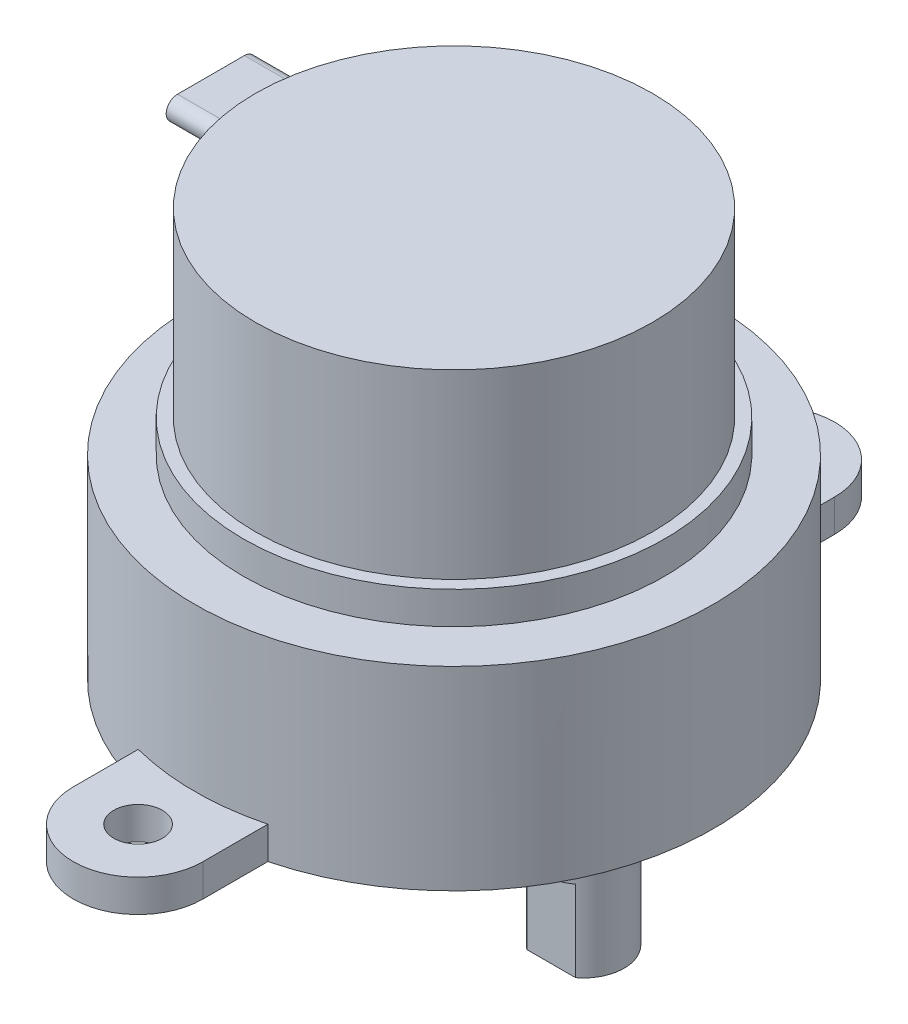
ISO-10303-21;
HEADER;
FILE_DESCRIPTION(('STEP AP214'),'2;1');
FILE_NAME('part.step','',(''),(''),'','','');
FILE_SCHEMA(('AUTOMOTIVE_DESIGN { 1 0 10303 214 1 1 1 1 }'));
ENDSEC;
DATA;
#1=APPLICATION_CONTEXT('core data for automotive mechanical design processes');
#2=APPLICATION_PROTOCOL_DEFINITION('international standard','automotive_design',2000,#1);
#3=PRODUCT_CONTEXT('',#1,'mechanical');
#4=PRODUCT('Part','Part','',(#3));
#5=PRODUCT_RELATED_PRODUCT_CATEGORY('part','',(#4));
#6=PRODUCT_DEFINITION_FORMATION('','',#4);
#7=PRODUCT_DEFINITION_CONTEXT('part definition',#1,'design');
#8=PRODUCT_DEFINITION('design','',#6,#7);
#9=PRODUCT_DEFINITION_SHAPE('','',#8);
#10=(LENGTH_UNIT() NAMED_UNIT(*) SI_UNIT(.MILLI.,.METRE.));
#11=(NAMED_UNIT(*) PLANE_ANGLE_UNIT() SI_UNIT($,.RADIAN.));
#12=(NAMED_UNIT(*) SI_UNIT($,.STERADIAN.) SOLID_ANGLE_UNIT());
#13=UNCERTAINTY_MEASURE_WITH_UNIT(LENGTH_MEASURE(1.E-05),#10,'distance_accuracy_value','');
#14=(GEOMETRIC_REPRESENTATION_CONTEXT(3) GLOBAL_UNCERTAINTY_ASSIGNED_CONTEXT((#13)) GLOBAL_UNIT_ASSIGNED_CONTEXT((#10,
#11,#12)) REPRESENTATION_CONTEXT('',''));
#15=CARTESIAN_POINT('',(0.,0.,0.));
#16=DIRECTION('',(0.,0.,1.));
#17=DIRECTION('',(1.,0.,0.));
#18=AXIS2_PLACEMENT_3D('',#15,#16,#17);
#19=CARTESIAN_POINT('',(0.,0.,0.));
#20=DIRECTION('',(0.,1.,0.));
#21=DIRECTION('',(0.,0.,1.));
#22=AXIS2_PLACEMENT_3D('',#19,#20,#21);
#23=PLANE('',#22);
#24=CARTESIAN_POINT('',(8.,0.,0.));
#25=DIRECTION('',(0.,1.,0.));
#26=DIRECTION('',(-1.,0.,0.));
#27=AXIS2_PLACEMENT_3D('',#24,#25,#26);
#28=CIRCLE('',#27,4.5);
#29=CARTESIAN_POINT('',(3.5,0.,0.));
#30=VERTEX_POINT('',#29);
#31=EDGE_CURVE('E273',#30,#30,#28,.T.);
#32=ORIENTED_EDGE('',*,*,#31,.T.);
#33=EDGE_LOOP('',(#32));
#34=FACE_BOUND('',#33,.T.);
#35=CARTESIAN_POINT('',(0.,0.,0.));
#36=DIRECTION('',(0.,-1.,0.));
#37=DIRECTION('',(0.,0.,-1.));
#38=AXIS2_PLACEMENT_3D('',#35,#36,#37);
#39=CIRCLE('',#38,16.);
#40=CARTESIAN_POINT('',(4.,0.,-15.4919333848297));
#41=VERTEX_POINT('',#40);
#42=CARTESIAN_POINT('',(3.99999999999999,0.,15.4919333848297));
#43=VERTEX_POINT('',#42);
#44=EDGE_CURVE('E292',#41,#43,#39,.T.);
#45=ORIENTED_EDGE('',*,*,#44,.T.);
#46=DIRECTION('',(0.,0.,1.));
#47=VECTOR('',#46,1.);
#48=CARTESIAN_POINT('',(4.,0.,-19.5));
#49=LINE('',#48,#47);
#50=CARTESIAN_POINT('',(3.99999999999999,0.,19.5));
#51=VERTEX_POINT('',#50);
#52=EDGE_CURVE('E221',#43,#51,#49,.T.);
#53=ORIENTED_EDGE('',*,*,#52,.T.);
#54=CARTESIAN_POINT('',(0.,0.,19.5));
#55=DIRECTION('',(0.,-1.,0.));
#56=DIRECTION('',(0.,0.,-1.));
#57=AXIS2_PLACEMENT_3D('',#54,#55,#56);
#58=CIRCLE('',#57,4.);
#59=CARTESIAN_POINT('',(-4.00000000000001,0.,19.5));
#60=VERTEX_POINT('',#59);
#61=EDGE_CURVE('E224',#51,#60,#58,.T.);
#62=ORIENTED_EDGE('',*,*,#61,.T.);
#63=DIRECTION('',(0.,0.,-1.));
#64=VECTOR('',#63,1.);
#65=CARTESIAN_POINT('',(-4.,0.,-19.5));
#66=LINE('',#65,#64);
#67=CARTESIAN_POINT('',(-4.,0.,15.4919333848297));
#68=VERTEX_POINT('',#67);
#69=EDGE_CURVE('E67',#60,#68,#66,.T.);
#70=ORIENTED_EDGE('',*,*,#69,.T.);
#71=CARTESIAN_POINT('',(-4.,0.,-15.4919333848297));
#72=VERTEX_POINT('',#71);
#73=EDGE_CURVE('E291',#68,#72,#39,.T.);
#74=ORIENTED_EDGE('',*,*,#73,.T.);
#75=CARTESIAN_POINT('',(-4.,0.,-19.5));
#76=VERTEX_POINT('',#75);
#77=EDGE_CURVE('E226',#72,#76,#66,.T.);
#78=ORIENTED_EDGE('',*,*,#77,.T.);
#79=CARTESIAN_POINT('',(0.,0.,-19.5));
#80=DIRECTION('',(0.,-1.,0.));
#81=DIRECTION('',(0.,0.,-1.));
#82=AXIS2_PLACEMENT_3D('',#79,#80,#81);
#83=CIRCLE('',#82,4.);
#84=CARTESIAN_POINT('',(4.,0.,-19.5));
#85=VERTEX_POINT('',#84);
#86=EDGE_CURVE('E201',#76,#85,#83,.T.);
#87=ORIENTED_EDGE('',*,*,#86,.T.);
#88=EDGE_CURVE('E222',#85,#41,#49,.T.);
#89=ORIENTED_EDGE('',*,*,#88,.T.);
#90=EDGE_LOOP('',(#45,#53,#62,#70,#74,#78,#87,#89));
#91=FACE_BOUND('',#90,.T.);
#92=CARTESIAN_POINT('',(0.,0.,-19.5));
#93=DIRECTION('',(0.,-1.,0.));
#94=DIRECTION('',(0.,0.,-1.));
#95=AXIS2_PLACEMENT_3D('',#92,#93,#94);
#96=CIRCLE('',#95,1.5);
#97=CARTESIAN_POINT('',(0.,0.,-21.));
#98=VERTEX_POINT('',#97);
#99=EDGE_CURVE('E195',#98,#98,#96,.T.);
#100=ORIENTED_EDGE('',*,*,#99,.F.);
#101=EDGE_LOOP('',(#100));
#102=FACE_BOUND('',#101,.T.);
#103=CARTESIAN_POINT('',(0.,0.,19.5));
#104=DIRECTION('',(0.,-1.,0.));
#105=DIRECTION('',(0.,0.,-1.));
#106=AXIS2_PLACEMENT_3D('',#103,#104,#105);
#107=CIRCLE('',#106,1.5);
#108=CARTESIAN_POINT('',(0.,0.,18.));
#109=VERTEX_POINT('',#108);
#110=EDGE_CURVE('E187',#109,#109,#107,.T.);
#111=ORIENTED_EDGE('',*,*,#110,.F.);
#112=EDGE_LOOP('',(#111));
#113=FACE_BOUND('',#112,.T.);
#114=ADVANCED_FACE('F40',(#34,#91,#102,#113),#23,.F.);
#115=CARTESIAN_POINT('',(0.,0.,0.));
#116=DIRECTION('',(0.,-1.,0.));
#117=DIRECTION('',(0.,0.,-1.));
#118=AXIS2_PLACEMENT_3D('',#115,#116,#117);
#119=CYLINDRICAL_SURFACE('',#118,16.);
#120=ORIENTED_EDGE('',*,*,#73,.F.);
#121=DIRECTION('',(0.,-1.,0.));
#122=VECTOR('',#121,1.);
#123=CARTESIAN_POINT('',(-4.,0.,15.4919333848297));
#124=LINE('',#123,#122);
#125=CARTESIAN_POINT('',(-4.,2.,15.4919333848297));
#126=VERTEX_POINT('',#125);
#127=EDGE_CURVE('E316',#68,#126,#124,.F.);
#128=ORIENTED_EDGE('',*,*,#127,.T.);
#129=CARTESIAN_POINT('',(0.,2.,0.));
#130=DIRECTION('',(0.,-1.,0.));
#131=DIRECTION('',(0.,0.,-1.));
#132=AXIS2_PLACEMENT_3D('',#129,#130,#131);
#133=CIRCLE('',#132,16.);
#134=CARTESIAN_POINT('',(3.99999999999999,2.,15.4919333848297));
#135=VERTEX_POINT('',#134);
#136=EDGE_CURVE('E307',#135,#126,#133,.T.);
#137=ORIENTED_EDGE('',*,*,#136,.F.);
#138=DIRECTION('',(0.,-1.,0.));
#139=VECTOR('',#138,1.);
#140=CARTESIAN_POINT('',(3.99999999999999,0.,15.4919333848297));
#141=LINE('',#140,#139);
#142=EDGE_CURVE('E313',#135,#43,#141,.T.);
#143=ORIENTED_EDGE('',*,*,#142,.T.);
#144=ORIENTED_EDGE('',*,*,#44,.F.);
#145=DIRECTION('',(0.,-1.,0.));
#146=VECTOR('',#145,1.);
#147=CARTESIAN_POINT('',(4.,0.,-15.4919333848297));
#148=LINE('',#147,#146);
#149=CARTESIAN_POINT('',(4.,2.,-15.4919333848297));
#150=VERTEX_POINT('',#149);
#151=EDGE_CURVE('E306',#41,#150,#148,.F.);
#152=ORIENTED_EDGE('',*,*,#151,.T.);
#153=CARTESIAN_POINT('',(-4.,2.,-15.4919333848297));
#154=VERTEX_POINT('',#153);
#155=EDGE_CURVE('E304',#154,#150,#133,.T.);
#156=ORIENTED_EDGE('',*,*,#155,.F.);
#157=DIRECTION('',(0.,-1.,0.));
#158=VECTOR('',#157,1.);
#159=CARTESIAN_POINT('',(-4.,0.,-15.4919333848297));
#160=LINE('',#159,#158);
#161=EDGE_CURVE('E310',#154,#72,#160,.T.);
#162=ORIENTED_EDGE('',*,*,#161,.T.);
#163=EDGE_LOOP('',(#120,#128,#137,#143,#144,#152,#156,#162));
#164=FACE_BOUND('',#163,.T.);
#165=CARTESIAN_POINT('',(0.,12.,0.));
#166=DIRECTION('',(0.,-1.,0.));
#167=DIRECTION('',(0.,0.,-1.));
#168=AXIS2_PLACEMENT_3D('',#165,#166,#167);
#169=CIRCLE('',#168,16.);
#170=CARTESIAN_POINT('',(0.,12.,-16.));
#171=VERTEX_POINT('',#170);
#172=EDGE_CURVE('E288',#171,#171,#169,.T.);
#173=ORIENTED_EDGE('',*,*,#172,.T.);
#174=EDGE_LOOP('',(#173));
#175=FACE_BOUND('',#174,.T.);
#176=ADVANCED_FACE('F430',(#164,#175),#119,.T.);
#177=CARTESIAN_POINT('',(-16.,12.,0.));
#178=DIRECTION('',(0.,-1.,0.));
#179=DIRECTION('',(0.,0.,-1.));
#180=AXIS2_PLACEMENT_3D('',#177,#178,#179);
#181=PLANE('',#180);
#182=ORIENTED_EDGE('',*,*,#172,.F.);
#183=EDGE_LOOP('',(#182));
#184=FACE_BOUND('',#183,.T.);
#185=CARTESIAN_POINT('',(0.,12.,0.));
#186=DIRECTION('',(0.,-1.,0.));
#187=DIRECTION('',(0.,0.,-1.));
#188=AXIS2_PLACEMENT_3D('',#185,#186,#187);
#189=CIRCLE('',#188,13.);
#190=CARTESIAN_POINT('',(0.,12.,-13.));
#191=VERTEX_POINT('',#190);
#192=EDGE_CURVE('E285',#191,#191,#189,.T.);
#193=ORIENTED_EDGE('',*,*,#192,.T.);
#194=EDGE_LOOP('',(#193));
#195=FACE_BOUND('',#194,.T.);
#196=ADVANCED_FACE('F435',(#184,#195),#181,.F.);
#197=CARTESIAN_POINT('',(0.,0.,0.));
#198=DIRECTION('',(0.,-1.,0.));
#199=DIRECTION('',(0.,0.,-1.));
#200=AXIS2_PLACEMENT_3D('',#197,#198,#199);
#201=CYLINDRICAL_SURFACE('',#200,13.);
#202=ORIENTED_EDGE('',*,*,#192,.F.);
#203=EDGE_LOOP('',(#202));
#204=FACE_BOUND('',#203,.T.);
#205=CARTESIAN_POINT('',(0.,14.,0.));
#206=DIRECTION('',(0.,-1.,0.));
#207=DIRECTION('',(0.,0.,-1.));
#208=AXIS2_PLACEMENT_3D('',#205,#206,#207);
#209=CIRCLE('',#208,13.);
#210=CARTESIAN_POINT('',(0.,14.,-13.));
#211=VERTEX_POINT('',#210);
#212=EDGE_CURVE('E282',#211,#211,#209,.T.);
#213=ORIENTED_EDGE('',*,*,#212,.T.);
#214=EDGE_LOOP('',(#213));
#215=FACE_BOUND('',#214,.T.);
#216=ADVANCED_FACE('F648',(#204,#215),#201,.T.);
#217=CARTESIAN_POINT('',(-13.,14.,0.));
#218=DIRECTION('',(0.,-1.,0.));
#219=DIRECTION('',(0.,0.,-1.));
#220=AXIS2_PLACEMENT_3D('',#217,#218,#219);
#221=PLANE('',#220);
#222=ORIENTED_EDGE('',*,*,#212,.F.);
#223=EDGE_LOOP('',(#222));
#224=FACE_BOUND('',#223,.T.);
#225=CARTESIAN_POINT('',(0.,14.,0.));
#226=DIRECTION('',(0.,-1.,0.));
#227=DIRECTION('',(0.,0.,-1.));
#228=AXIS2_PLACEMENT_3D('',#225,#226,#227);
#229=CIRCLE('',#228,12.25);
#230=CARTESIAN_POINT('',(0.,14.,-12.25));
#231=VERTEX_POINT('',#230);
#232=EDGE_CURVE('E279',#231,#231,#229,.T.);
#233=ORIENTED_EDGE('',*,*,#232,.T.);
#234=EDGE_LOOP('',(#233));
#235=FACE_BOUND('',#234,.T.);
#236=ADVANCED_FACE('F426',(#224,#235),#221,.F.);
#237=CARTESIAN_POINT('',(0.,0.,0.));
#238=DIRECTION('',(0.,-1.,0.));
#239=DIRECTION('',(0.,0.,-1.));
#240=AXIS2_PLACEMENT_3D('',#237,#238,#239);
#241=CYLINDRICAL_SURFACE('',#240,12.25);
#242=CARTESIAN_POINT('',(0.,24.8102935502322,0.));
#243=DIRECTION('',(0.,-1.,0.));
#244=DIRECTION('',(0.,0.,-1.));
#245=AXIS2_PLACEMENT_3D('',#242,#243,#244);
#246=CIRCLE('',#245,12.25);
#247=CARTESIAN_POINT('',(-12.0746386421325,24.8102935502322,2.06533330528554));
#248=VERTEX_POINT('',#247);
#249=CARTESIAN_POINT('',(-12.0746386421325,24.8102935502322,-2.06533330528554));
#250=VERTEX_POINT('',#249);
#251=EDGE_CURVE('E52',#248,#250,#246,.T.);
#252=ORIENTED_EDGE('',*,*,#251,.F.);
#253=CARTESIAN_POINT('',(-12.1736877517312,24.1101805653897,1.36522032044298));
#254=CARTESIAN_POINT('',(-12.1736877254974,24.1492983631001,1.36522205826182));
#255=CARTESIAN_POINT('',(-12.1733202199056,24.1884437928392,1.36851003883782));
#256=CARTESIAN_POINT('',(-12.1718440130067,24.26565372532,1.38157695674786));
#257=CARTESIAN_POINT('',(-12.1707344440778,24.3037169083244,1.39136349210879));
#258=CARTESIAN_POINT('',(-12.1677602722196,24.3776317389549,1.41713698782575));
#259=CARTESIAN_POINT('',(-12.1658960781671,24.4134845721068,1.43312059024172));
#260=CARTESIAN_POINT('',(-12.1613965948713,24.4819759922711,1.47081315580985));
#261=CARTESIAN_POINT('',(-12.1587614918081,24.5146153528196,1.49252073645505));
#262=CARTESIAN_POINT('',(-12.1527033761418,24.575836841953,1.5410705296342));
#263=CARTESIAN_POINT('',(-12.1492789063223,24.6044113067581,1.56792222281675));
#264=CARTESIAN_POINT('',(-12.1416492660843,24.6566446597768,1.62594823862026));
#265=CARTESIAN_POINT('',(-12.137444051561,24.6803032701299,1.65712280541863));
#266=CARTESIAN_POINT('',(-12.1282562018091,24.7221921106059,1.72308299167752));
#267=CARTESIAN_POINT('',(-12.1232691725918,24.740389853456,1.75788862430097));
#268=CARTESIAN_POINT('',(-12.1126003766949,24.7706985050246,1.82995574107636));
#269=CARTESIAN_POINT('',(-12.1069185769698,24.7828091240796,1.86721734200328));
#270=CARTESIAN_POINT('',(-12.0949031784823,24.8007420088311,1.94353374546836));
#271=CARTESIAN_POINT('',(-12.088563515276,24.8064987851686,1.98260297589541));
#272=CARTESIAN_POINT('',(-12.0754312617295,24.8113838224086,2.06107807197321));
#273=CARTESIAN_POINT('',(-12.0686386388353,24.8105116063782,2.10048396164168));
#274=CARTESIAN_POINT('',(-12.054706976681,24.8021422239762,2.17902495272667));
#275=CARTESIAN_POINT('',(-12.0475647253628,24.7945644801897,2.21815090720408));
#276=CARTESIAN_POINT('',(-12.033247439735,24.7728976893347,2.29455177185041));
#277=CARTESIAN_POINT('',(-12.0260724033596,24.758808226213,2.33182656357447));
#278=CARTESIAN_POINT('',(-12.0119064614862,24.7243795953467,2.40373804618856));
#279=CARTESIAN_POINT('',(-12.0049171767106,24.7039977913366,2.43835466364108));
#280=CARTESIAN_POINT('',(-11.9914662720498,24.6575623621294,2.50366732948619));
#281=CARTESIAN_POINT('',(-11.9850046458184,24.6315088051622,2.53436342503478));
#282=CARTESIAN_POINT('',(-11.9729453429544,24.5746202996017,2.59073485167142));
#283=CARTESIAN_POINT('',(-11.9673422506743,24.5438180104977,2.61644195333348));
#284=CARTESIAN_POINT('',(-11.9572268811007,24.478155810664,2.66228818375921));
#285=CARTESIAN_POINT('',(-11.9527144732588,24.4432963862898,2.68242797893775));
#286=CARTESIAN_POINT('',(-11.9450999960425,24.3712672356194,2.7161332788627));
#287=CARTESIAN_POINT('',(-11.9419709507665,24.3341593990849,2.72982490657605));
#288=CARTESIAN_POINT('',(-11.9371612203369,24.2580824524857,2.7507815159336));
#289=CARTESIAN_POINT('',(-11.9354803221957,24.2191136170192,2.75804744264757));
#290=CARTESIAN_POINT('',(-11.9336815518562,24.1413366434073,2.76581999203704));
#291=CARTESIAN_POINT('',(-11.9335302752034,24.1025436554546,2.76647107373272));
#292=CARTESIAN_POINT('',(-11.9347119583579,24.0254059606216,2.76136871084138));
#293=CARTESIAN_POINT('',(-11.9360448310062,23.9870612275505,2.75561564234765));
#294=CARTESIAN_POINT('',(-11.9401074165857,23.9121821093923,2.73795822806853));
#295=CARTESIAN_POINT('',(-11.9428272308043,23.8756368808709,2.72609746755356));
#296=CARTESIAN_POINT('',(-11.9495165845125,23.8050694756962,2.69662389838932));
#297=CARTESIAN_POINT('',(-11.9534861912136,23.7710474348565,2.67901078038773));
#298=CARTESIAN_POINT('',(-11.962537814612,23.7060047352606,2.6383001736938));
#299=CARTESIAN_POINT('',(-11.9676335332924,23.6750285038672,2.61513480548397));
#300=CARTESIAN_POINT('',(-11.978666876579,23.6173820595454,2.56412157750261));
#301=CARTESIAN_POINT('',(-11.9846046005545,23.5907123556475,2.53627316498938));
#302=CARTESIAN_POINT('',(-11.9972077805567,23.541788572937,2.4759793546236));
#303=CARTESIAN_POINT('',(-12.0038868205838,23.5196500032179,2.44344305113389));
#304=CARTESIAN_POINT('',(-12.0175796939132,23.4811431395247,2.37518190760597));
#305=CARTESIAN_POINT('',(-12.0245935617255,23.4647754418077,2.33945673856589));
#306=CARTESIAN_POINT('',(-12.0388159692639,23.4380036887197,2.26514119375836));
#307=CARTESIAN_POINT('',(-12.0460257685035,23.4277089127466,2.22651164166629));
#308=CARTESIAN_POINT('',(-12.0602673070554,23.4138278478539,2.14803223801755));
#309=CARTESIAN_POINT('',(-12.0672990406922,23.4102417724974,2.108182347654));
#310=CARTESIAN_POINT('',(-12.0809888169475,23.4099053151052,2.0282646249905));
#311=CARTESIAN_POINT('',(-12.0876456821538,23.4131753578591,1.98819649717138));
#312=CARTESIAN_POINT('',(-12.100386911044,23.4265407447426,1.90912043508188));
#313=CARTESIAN_POINT('',(-12.1064712981579,23.4366358094037,1.87011245746888));
#314=CARTESIAN_POINT('',(-12.1178863606341,23.463283057577,1.79465167025139));
#315=CARTESIAN_POINT('',(-12.1232233052854,23.4797765285587,1.75817908502053));
#316=CARTESIAN_POINT('',(-12.1331247788137,23.518786729213,1.68849723046606));
#317=CARTESIAN_POINT('',(-12.1376893877339,23.5413028340883,1.65528762312448));
#318=CARTESIAN_POINT('',(-12.1459519555006,23.5914181662129,1.59352188349984));
#319=CARTESIAN_POINT('',(-12.1496599334162,23.6189510918183,1.56491328425731));
#320=CARTESIAN_POINT('',(-12.1562700126643,23.678515669718,1.51271071117994));
#321=CARTESIAN_POINT('',(-12.1591719584893,23.7105481883254,1.48911770520811));
#322=CARTESIAN_POINT('',(-12.1641548848393,23.777889085206,1.44784863426802));
#323=CARTESIAN_POINT('',(-12.1662427776655,23.8131665909343,1.4301229523433));
#324=CARTESIAN_POINT('',(-12.1696479842149,23.8862001779052,1.4008522919677));
#325=CARTESIAN_POINT('',(-12.170966227102,23.9239532090243,1.38929986226065));
#326=CARTESIAN_POINT('',(-12.1725026109203,23.9866502016298,1.37575651677231));
#327=CARTESIAN_POINT('',(-12.1729471653415,24.0111838590511,1.37181064402188));
#328=CARTESIAN_POINT('',(-12.1735397437207,24.0605348226494,1.36654199746301));
#329=CARTESIAN_POINT('',(-12.173687768382,24.0853521281535,1.36521921743289));
#330=CARTESIAN_POINT('',(-12.1736877517312,24.1101805653897,1.36522032044298));
#331=B_SPLINE_CURVE_WITH_KNOTS('',3,(#253,#254,#255,#256,#257,#258,#259,#260,#261,#262,#263,
#264,#265,#266,#267,#268,#269,#270,#271,#272,#273,#274,#275,#276,#277,#278,#279,#280,#281,#282,
#283,#284,#285,#286,#287,#288,#289,#290,#291,#292,#293,#294,#295,#296,#297,#298,#299,#300,#301,
#302,#303,#304,#305,#306,#307,#308,#309,#310,#311,#312,#313,#314,#315,#316,#317,#318,#319,#320,
#321,#322,#323,#324,#325,#326,#327,#328,#329,#330),.UNSPECIFIED.,.T.,.F.,(4,2,2,2,2,2,2,2,2,2,2,
2,2,2,2,2,2,2,2,2,2,2,2,2,2,2,2,2,2,2,2,2,2,2,2,2,2,2,4),(0.,0.117262675872176,
0.234662695731848,0.351999189973885,0.469307369962972,0.58683386695087,0.704367005126478,
0.822586096772288,0.940810813492129,1.06024301719149,1.17968381370322,1.30057966888554,
1.42148324953259,1.54322474107094,1.66496476816604,1.78590208516979,1.90682491952185,
2.02527275290292,2.14370316248969,2.25954150762198,2.37537305033327,2.49038922918037,
2.60541159442702,2.72191916910759,2.83844050489043,2.95763855661924,3.0768489205048,
3.19814369754668,3.31944233578783,3.44110284335926,3.56275836952321,3.68332301368145,
3.80387515512561,3.92293653519305,4.04202086981623,4.16007078560315,4.27797788874291,
4.35240579788189,4.42683353048557),.UNSPECIFIED.);
#332=CARTESIAN_POINT('',(-12.0746386421325,23.4100675805471,2.06533330528554));
#333=VERTEX_POINT('',#332);
#334=EDGE_CURVE('E11',#248,#333,#331,.T.);
#335=ORIENTED_EDGE('',*,*,#334,.T.);
#336=CARTESIAN_POINT('',(0.,23.4100675805471,0.));
#337=DIRECTION('',(0.,-1.,0.));
#338=DIRECTION('',(0.,0.,-1.));
#339=AXIS2_PLACEMENT_3D('',#336,#337,#338);
#340=CIRCLE('',#339,12.25);
#341=CARTESIAN_POINT('',(-12.0746386421325,23.4100675805471,-2.06533330528554));
#342=VERTEX_POINT('',#341);
#343=EDGE_CURVE('E165',#333,#342,#340,.T.);
#344=ORIENTED_EDGE('',*,*,#343,.T.);
#345=CARTESIAN_POINT('',(-11.9337675030318,24.1101805653897,-2.7654462901281));
#346=CARTESIAN_POINT('',(-11.9337680956192,24.1488079021122,-2.76544446717352));
#347=CARTESIAN_POINT('',(-11.934512515291,24.1874629440265,-2.76223740519561));
#348=CARTESIAN_POINT('',(-11.9374523762178,24.2636912883705,-2.7495039016505));
#349=CARTESIAN_POINT('',(-11.9396495356853,24.3012632548226,-2.7399699770047));
#350=CARTESIAN_POINT('',(-11.9453745111221,24.3741950107557,-2.71490181671405));
#351=CARTESIAN_POINT('',(-11.9489008543774,24.4095571982672,-2.69937422150171));
#352=CARTESIAN_POINT('',(-11.9571032982876,24.4771443721366,-2.66280494871443));
#353=CARTESIAN_POINT('',(-11.961779200496,24.5093698986326,-2.64176422282162));
#354=CARTESIAN_POINT('',(-11.9721240902187,24.570250786157,-2.59448188708469));
#355=CARTESIAN_POINT('',(-11.9778051709378,24.5988544237965,-2.5681763640804));
#356=CARTESIAN_POINT('',(-11.9898603201587,24.651266751266,-2.51129318573673));
#357=CARTESIAN_POINT('',(-11.9962344901508,24.6750747374012,-2.48071490454311));
#358=CARTESIAN_POINT('',(-12.0095614955851,24.7177840831199,-2.41538145629968));
#359=CARTESIAN_POINT('',(-12.0165242355698,24.7365606839957,-2.38054671495616));
#360=CARTESIAN_POINT('',(-12.0306216681132,24.7679843912128,-2.3082456548345));
#361=CARTESIAN_POINT('',(-12.0377563755952,24.7806309635701,-2.27077910712627));
#362=CARTESIAN_POINT('',(-12.052038791325,24.7995785592907,-2.19372187896276));
#363=CARTESIAN_POINT('',(-12.0591853850659,24.8057919965302,-2.1541094149488));
#364=CARTESIAN_POINT('',(-12.0731610241054,24.8113760702939,-2.07434855312481));
#365=CARTESIAN_POINT('',(-12.0799900688851,24.810746695636,-2.03420015443909));
#366=CARTESIAN_POINT('',(-12.0931289984466,24.802632429883,-1.95457341135682));
#367=CARTESIAN_POINT('',(-12.099439614257,24.7951573790767,-1.9150941879996));
#368=CARTESIAN_POINT('',(-12.1114054646612,24.7735352524838,-1.83790202366018));
#369=CARTESIAN_POINT('',(-12.1170607347921,24.7593885386889,-1.80018898697006));
#370=CARTESIAN_POINT('',(-12.1275570333059,24.7249823168475,-1.72805553416425));
#371=CARTESIAN_POINT('',(-12.1324062998632,24.7047914429911,-1.69360358463959));
#372=CARTESIAN_POINT('',(-12.1413081510958,24.6587929755735,-1.62856238865046));
#373=CARTESIAN_POINT('',(-12.1453607868148,24.6329857421006,-1.59797289474635));
#374=CARTESIAN_POINT('',(-12.1526040533489,24.5768162721784,-1.54191638470338));
#375=CARTESIAN_POINT('',(-12.1558042431742,24.546511052515,-1.51639346031963));
#376=CARTESIAN_POINT('',(-12.1614063318243,24.4819842868891,-1.47079080799685));
#377=CARTESIAN_POINT('',(-12.1638082654676,24.4477629118295,-1.45071084265321));
#378=CARTESIAN_POINT('',(-12.1678127494201,24.3766630403909,-1.41673031323701));
#379=CARTESIAN_POINT('',(-12.1694213448026,24.3398071675285,-1.40278311014077));
#380=CARTESIAN_POINT('',(-12.1718835739299,24.2642565406534,-1.38125619553864));
#381=CARTESIAN_POINT('',(-12.1727372247413,24.2255618282308,-1.37367634009071));
#382=CARTESIAN_POINT('',(-12.1736992714031,24.1475815313241,-1.36512448087331));
#383=CARTESIAN_POINT('',(-12.1738103408825,24.1082985775503,-1.36412877134093));
#384=CARTESIAN_POINT('',(-12.1732959448572,24.0301231313743,-1.36871142034707));
#385=CARTESIAN_POINT('',(-12.1726704863992,23.99123063524,-1.37428971598876));
#386=CARTESIAN_POINT('',(-12.1706751921196,23.9149724179892,-1.39184859898824));
#387=CARTESIAN_POINT('',(-12.1693059622384,23.8776054806279,-1.40382397460115));
#388=CARTESIAN_POINT('',(-12.1658079894434,23.8054216791749,-1.43382099275774));
#389=CARTESIAN_POINT('',(-12.1636792475529,23.7706048116475,-1.45184262715489));
#390=CARTESIAN_POINT('',(-12.1586428773062,23.7044509099649,-1.49343264869524));
#391=CARTESIAN_POINT('',(-12.1557341213645,23.6731190071709,-1.51700905976602));
#392=CARTESIAN_POINT('',(-12.1491324156091,23.6148650586341,-1.56900173433106));
#393=CARTESIAN_POINT('',(-12.1454394555193,23.5879430706856,-1.59741806124508));
#394=CARTESIAN_POINT('',(-12.1372630583516,23.5391318233834,-1.6584011329547));
#395=CARTESIAN_POINT('',(-12.1327761059114,23.5172659864478,-1.6909861488998));
#396=CARTESIAN_POINT('',(-12.1230645921748,23.4793061560384,-1.75925906405772));
#397=CARTESIAN_POINT('',(-12.1178400030006,23.4632123807911,-1.79494708052345));
#398=CARTESIAN_POINT('',(-12.1066814169782,23.4370889859058,-1.86873440912535));
#399=CARTESIAN_POINT('',(-12.1007415624929,23.4271141770683,-1.90685223310998));
#400=CARTESIAN_POINT('',(-12.0883105362144,23.4136871904498,-1.98413203389256));
#401=CARTESIAN_POINT('',(-12.081819325761,23.4102354704519,-2.02329408377755));
#402=CARTESIAN_POINT('',(-12.0683672265577,23.4099097151544,-2.10205313934328));
#403=CARTESIAN_POINT('',(-12.0614016026527,23.4131158269099,-2.14164967029103));
#404=CARTESIAN_POINT('',(-12.0472815221053,23.4261527429723,-2.21970310037314));
#405=CARTESIAN_POINT('',(-12.0401270516798,23.4359840321187,-2.25815991588655));
#406=CARTESIAN_POINT('',(-12.0258047038226,23.4621213858125,-2.33323735401496));
#407=CARTESIAN_POINT('',(-12.0186373662502,23.4784891671804,-2.36983661430382));
#408=CARTESIAN_POINT('',(-12.0046383827656,23.5172551109512,-2.4397602801653));
#409=CARTESIAN_POINT('',(-11.9978067313277,23.5396531740527,-2.47308473965214));
#410=CARTESIAN_POINT('',(-11.9847836077134,23.5898409772369,-2.53544404898947));
#411=CARTESIAN_POINT('',(-11.9785910885676,23.6176216779982,-2.5644859487234));
#412=CARTESIAN_POINT('',(-11.967123815125,23.6778560915428,-2.61747678289224));
#413=CARTESIAN_POINT('',(-11.9618492084604,23.7103105544975,-2.64142489820768));
#414=CARTESIAN_POINT('',(-11.9525660715434,23.7784113330146,-2.68311657363912));
#415=CARTESIAN_POINT('',(-11.9485383713045,23.8139972533596,-2.70095457980114));
#416=CARTESIAN_POINT('',(-11.9418538824011,23.8877576235672,-2.73035815060102));
#417=CARTESIAN_POINT('',(-11.9391952030561,23.9259284206595,-2.74193236695242));
#418=CARTESIAN_POINT('',(-11.9361257865481,23.9886726735579,-2.7552542774532));
#419=CARTESIAN_POINT('',(-11.9352434298279,24.0128036196444,-2.75907070913704));
#420=CARTESIAN_POINT('',(-11.9340641053369,24.0613462100968,-2.76416727182467));
#421=CARTESIAN_POINT('',(-11.9337671283594,24.0857578500419,-2.76544744271859));
#422=CARTESIAN_POINT('',(-11.9337675030318,24.1101805653897,-2.7654462901281));
#423=B_SPLINE_CURVE_WITH_KNOTS('',3,(#345,#346,#347,#348,#349,#350,#351,#352,#353,#354,#355,
#356,#357,#358,#359,#360,#361,#362,#363,#364,#365,#366,#367,#368,#369,#370,#371,#372,#373,#374,
#375,#376,#377,#378,#379,#380,#381,#382,#383,#384,#385,#386,#387,#388,#389,#390,#391,#392,#393,
#394,#395,#396,#397,#398,#399,#400,#401,#402,#403,#404,#405,#406,#407,#408,#409,#410,#411,#412,
#413,#414,#415,#416,#417,#418,#419,#420,#421,#422),.UNSPECIFIED.,.T.,.F.,(4,2,2,2,2,2,2,2,2,2,2,
2,2,2,2,2,2,2,2,2,2,2,2,2,2,2,2,2,2,2,2,2,2,2,2,2,2,2,4),(0.,0.115791532442654,
0.231720261656373,0.347520919510731,0.463301600893951,0.580583887704926,0.697883371536332,
0.817867288558253,0.937861655446415,1.05946906161143,1.18107666650099,1.30250974094914,
1.42393622742595,1.54403303967427,1.66412215427924,1.78280179261299,1.90147625368408,
2.01923190344142,2.13698489111016,2.25431368534472,2.3716413570445,2.48887358654578,
2.60610565809298,2.72350812210554,2.84091212461755,2.95884956232694,3.07679145847054,
3.19577495791367,3.31476680717668,3.43519938141968,3.55564077003754,3.67724730705563,
3.79885184168594,3.92025390283677,4.04167547163215,4.1611251521802,4.28040942180596,
4.35362151342955,4.42683245356887),.UNSPECIFIED.);
#424=EDGE_CURVE('E320',#342,#250,#423,.T.);
#425=ORIENTED_EDGE('',*,*,#424,.T.);
#426=EDGE_LOOP('',(#252,#335,#344,#425));
#427=FACE_BOUND('',#426,.T.);
#428=ORIENTED_EDGE('',*,*,#232,.F.);
#429=EDGE_LOOP('',(#428));
#430=FACE_BOUND('',#429,.T.);
#431=CARTESIAN_POINT('',(0.,25.2,0.));
#432=DIRECTION('',(0.,-1.,0.));
#433=DIRECTION('',(0.,0.,-1.));
#434=AXIS2_PLACEMENT_3D('',#431,#432,#433);
#435=CIRCLE('',#434,12.25);
#436=CARTESIAN_POINT('',(0.,25.2,-12.25));
#437=VERTEX_POINT('',#436);
#438=EDGE_CURVE('E276',#437,#437,#435,.T.);
#439=ORIENTED_EDGE('',*,*,#438,.T.);
#440=EDGE_LOOP('',(#439));
#441=FACE_BOUND('',#440,.T.);
#442=ADVANCED_FACE('F326',(#427,#430,#441),#241,.T.);
#443=CARTESIAN_POINT('',(-12.25,25.2,0.));
#444=DIRECTION('',(0.,-1.,0.));
#445=DIRECTION('',(0.,0.,-1.));
#446=AXIS2_PLACEMENT_3D('',#443,#444,#445);
#447=PLANE('',#446);
#448=ORIENTED_EDGE('',*,*,#438,.F.);
#449=EDGE_LOOP('',(#448));
#450=FACE_BOUND('',#449,.T.);
#451=ADVANCED_FACE('F419',(#450),#447,.F.);
#452=CARTESIAN_POINT('',(8.,0.,0.));
#453=DIRECTION('',(0.,1.,0.));
#454=DIRECTION('',(-1.,0.,0.));
#455=AXIS2_PLACEMENT_3D('',#452,#453,#454);
#456=CYLINDRICAL_SURFACE('',#455,4.5);
#457=CARTESIAN_POINT('',(8.,-1.25,0.));
#458=DIRECTION('',(0.,1.,0.));
#459=DIRECTION('',(-1.,0.,0.));
#460=AXIS2_PLACEMENT_3D('',#457,#458,#459);
#461=CIRCLE('',#460,4.5);
#462=CARTESIAN_POINT('',(3.5,-1.25,0.));
#463=VERTEX_POINT('',#462);
#464=EDGE_CURVE('E270',#463,#463,#461,.T.);
#465=ORIENTED_EDGE('',*,*,#464,.T.);
#466=EDGE_LOOP('',(#465));
#467=FACE_BOUND('',#466,.T.);
#468=ORIENTED_EDGE('',*,*,#31,.F.);
#469=EDGE_LOOP('',(#468));
#470=FACE_BOUND('',#469,.T.);
#471=ADVANCED_FACE('F416',(#467,#470),#456,.T.);
#472=CARTESIAN_POINT('',(4.,-1.25,0.));
#473=DIRECTION('',(0.,-1.,0.));
#474=DIRECTION('',(1.,0.,0.));
#475=AXIS2_PLACEMENT_3D('',#472,#473,#474);
#476=PLANE('',#475);
#477=CARTESIAN_POINT('',(8.,-1.25,0.));
#478=DIRECTION('',(0.,1.,0.));
#479=DIRECTION('',(-1.,0.,0.));
#480=AXIS2_PLACEMENT_3D('',#477,#478,#479);
#481=CIRCLE('',#480,4.);
#482=CARTESIAN_POINT('',(4.,-1.25,0.));
#483=VERTEX_POINT('',#482);
#484=EDGE_CURVE('E267',#483,#483,#481,.T.);
#485=ORIENTED_EDGE('',*,*,#484,.T.);
#486=EDGE_LOOP('',(#485));
#487=FACE_BOUND('',#486,.T.);
#488=ORIENTED_EDGE('',*,*,#464,.F.);
#489=EDGE_LOOP('',(#488));
#490=FACE_BOUND('',#489,.T.);
#491=ADVANCED_FACE('F412',(#487,#490),#476,.T.);
#492=CARTESIAN_POINT('',(8.,0.,0.));
#493=DIRECTION('',(0.,1.,0.));
#494=DIRECTION('',(-1.,0.,0.));
#495=AXIS2_PLACEMENT_3D('',#492,#493,#494);
#496=CYLINDRICAL_SURFACE('',#495,4.);
#497=CARTESIAN_POINT('',(8.,-2.7,0.));
#498=DIRECTION('',(0.,1.,0.));
#499=DIRECTION('',(-1.,0.,0.));
#500=AXIS2_PLACEMENT_3D('',#497,#498,#499);
#501=CIRCLE('',#500,4.);
#502=CARTESIAN_POINT('',(4.,-2.7,0.));
#503=VERTEX_POINT('',#502);
#504=EDGE_CURVE('E264',#503,#503,#501,.T.);
#505=ORIENTED_EDGE('',*,*,#504,.T.);
#506=EDGE_LOOP('',(#505));
#507=FACE_BOUND('',#506,.T.);
#508=ORIENTED_EDGE('',*,*,#484,.F.);
#509=EDGE_LOOP('',(#508));
#510=FACE_BOUND('',#509,.T.);
#511=ADVANCED_FACE('F408',(#507,#510),#496,.T.);
#512=CARTESIAN_POINT('',(4.,-2.7,0.));
#513=DIRECTION('',(0.,-1.,0.));
#514=DIRECTION('',(1.,0.,0.));
#515=AXIS2_PLACEMENT_3D('',#512,#513,#514);
#516=PLANE('',#515);
#517=CARTESIAN_POINT('',(8.,-2.7,0.));
#518=DIRECTION('',(0.,1.,0.));
#519=DIRECTION('',(-1.,0.,0.));
#520=AXIS2_PLACEMENT_3D('',#517,#518,#519);
#521=CIRCLE('',#520,2.5);
#522=CARTESIAN_POINT('',(5.5,-2.7,0.));
#523=VERTEX_POINT('',#522);
#524=EDGE_CURVE('E261',#523,#523,#521,.T.);
#525=ORIENTED_EDGE('',*,*,#524,.T.);
#526=EDGE_LOOP('',(#525));
#527=FACE_BOUND('',#526,.T.);
#528=ORIENTED_EDGE('',*,*,#504,.F.);
#529=EDGE_LOOP('',(#528));
#530=FACE_BOUND('',#529,.T.);
#531=ADVANCED_FACE('F404',(#527,#530),#516,.T.);
#532=CARTESIAN_POINT('',(8.,0.,0.));
#533=DIRECTION('',(0.,1.,0.));
#534=DIRECTION('',(-1.,0.,0.));
#535=AXIS2_PLACEMENT_3D('',#532,#533,#534);
#536=CYLINDRICAL_SURFACE('',#535,2.5);
#537=DIRECTION('',(0.,1.,0.));
#538=VECTOR('',#537,1.);
#539=CARTESIAN_POINT('',(6.5,0.,2.));
#540=LINE('',#539,#538);
#541=CARTESIAN_POINT('',(6.5,-5.2,2.));
#542=VERTEX_POINT('',#541);
#543=CARTESIAN_POINT('',(6.5,-10.2,2.));
#544=VERTEX_POINT('',#543);
#545=EDGE_CURVE('E249',#542,#544,#540,.F.);
#546=ORIENTED_EDGE('',*,*,#545,.F.);
#547=CARTESIAN_POINT('',(8.,-5.2,0.));
#548=DIRECTION('',(0.,-1.,0.));
#549=DIRECTION('',(1.,0.,0.));
#550=AXIS2_PLACEMENT_3D('',#547,#548,#549);
#551=CIRCLE('',#550,2.5);
#552=CARTESIAN_POINT('',(9.5,-5.2,2.));
#553=VERTEX_POINT('',#552);
#554=EDGE_CURVE('E301',#542,#553,#551,.F.);
#555=ORIENTED_EDGE('',*,*,#554,.T.);
#556=DIRECTION('',(0.,1.,0.));
#557=VECTOR('',#556,1.);
#558=CARTESIAN_POINT('',(9.5,0.,2.));
#559=LINE('',#558,#557);
#560=CARTESIAN_POINT('',(9.5,-10.2,2.));
#561=VERTEX_POINT('',#560);
#562=EDGE_CURVE('E247',#561,#553,#559,.T.);
#563=ORIENTED_EDGE('',*,*,#562,.F.);
#564=CARTESIAN_POINT('',(8.,-10.2,0.));
#565=DIRECTION('',(0.,1.,0.));
#566=DIRECTION('',(-1.,0.,0.));
#567=AXIS2_PLACEMENT_3D('',#564,#565,#566);
#568=CIRCLE('',#567,2.5);
#569=CARTESIAN_POINT('',(9.5,-10.2,-2.));
#570=VERTEX_POINT('',#569);
#571=EDGE_CURVE('E260',#561,#570,#568,.T.);
#572=ORIENTED_EDGE('',*,*,#571,.T.);
#573=DIRECTION('',(0.,1.,0.));
#574=VECTOR('',#573,1.);
#575=CARTESIAN_POINT('',(9.5,0.,-2.));
#576=LINE('',#575,#574);
#577=CARTESIAN_POINT('',(9.5,-5.2,-2.));
#578=VERTEX_POINT('',#577);
#579=EDGE_CURVE('E245',#578,#570,#576,.F.);
#580=ORIENTED_EDGE('',*,*,#579,.F.);
#581=CARTESIAN_POINT('',(8.,-5.2,0.));
#582=DIRECTION('',(0.,1.,0.));
#583=DIRECTION('',(-1.,0.,0.));
#584=AXIS2_PLACEMENT_3D('',#581,#582,#583);
#585=CIRCLE('',#584,2.5);
#586=CARTESIAN_POINT('',(6.5,-5.2,-2.));
#587=VERTEX_POINT('',#586);
#588=EDGE_CURVE('E299',#587,#578,#585,.F.);
#589=ORIENTED_EDGE('',*,*,#588,.F.);
#590=DIRECTION('',(0.,1.,0.));
#591=VECTOR('',#590,1.);
#592=CARTESIAN_POINT('',(6.5,0.,-2.));
#593=LINE('',#592,#591);
#594=CARTESIAN_POINT('',(6.5,-10.2,-2.));
#595=VERTEX_POINT('',#594);
#596=EDGE_CURVE('E241',#595,#587,#593,.T.);
#597=ORIENTED_EDGE('',*,*,#596,.F.);
#598=EDGE_CURVE('E257',#595,#544,#568,.T.);
#599=ORIENTED_EDGE('',*,*,#598,.T.);
#600=EDGE_LOOP('',(#546,#555,#563,#572,#580,#589,#597,#599));
#601=FACE_BOUND('',#600,.T.);
#602=ORIENTED_EDGE('',*,*,#524,.F.);
#603=EDGE_LOOP('',(#602));
#604=FACE_BOUND('',#603,.T.);
#605=ADVANCED_FACE('F400',(#601,#604),#536,.T.);
#606=CARTESIAN_POINT('',(5.5,-10.2,0.));
#607=DIRECTION('',(0.,-1.,0.));
#608=DIRECTION('',(1.,0.,0.));
#609=AXIS2_PLACEMENT_3D('',#606,#607,#608);
#610=PLANE('',#609);
#611=DIRECTION('',(1.,0.,0.));
#612=VECTOR('',#611,1.);
#613=CARTESIAN_POINT('',(5.5,-10.2,2.));
#614=LINE('',#613,#612);
#615=EDGE_CURVE('E297',#544,#561,#614,.T.);
#616=ORIENTED_EDGE('',*,*,#615,.F.);
#617=ORIENTED_EDGE('',*,*,#598,.F.);
#618=DIRECTION('',(-1.,0.,0.));
#619=VECTOR('',#618,1.);
#620=CARTESIAN_POINT('',(5.5,-10.2,-2.));
#621=LINE('',#620,#619);
#622=EDGE_CURVE('E295',#570,#595,#621,.T.);
#623=ORIENTED_EDGE('',*,*,#622,.F.);
#624=ORIENTED_EDGE('',*,*,#571,.F.);
#625=EDGE_LOOP('',(#616,#617,#623,#624));
#626=FACE_BOUND('',#625,.T.);
#627=CARTESIAN_POINT('',(8.,-10.2,0.));
#628=DIRECTION('',(0.,-1.,0.));
#629=DIRECTION('',(0.,0.,-1.));
#630=AXIS2_PLACEMENT_3D('',#627,#628,#629);
#631=CIRCLE('',#630,1.24999999999999);
#632=CARTESIAN_POINT('',(8.,-10.2,-1.24999999999999));
#633=VERTEX_POINT('',#632);
#634=EDGE_CURVE('E251',#633,#633,#631,.T.);
#635=ORIENTED_EDGE('',*,*,#634,.F.);
#636=EDGE_LOOP('',(#635));
#637=FACE_BOUND('',#636,.T.);
#638=ADVANCED_FACE('F396',(#626,#637),#610,.T.);
#639=CARTESIAN_POINT('',(8.,-2.7,0.));
#640=DIRECTION('',(0.,-1.,0.));
#641=DIRECTION('',(0.,0.,-1.));
#642=AXIS2_PLACEMENT_3D('',#639,#640,#641);
#643=CONICAL_SURFACE('',#642,1.24999999999999,1.02974425867665);
#644=CARTESIAN_POINT('',(8.,-1.94892422621555,0.));
#645=VERTEX_POINT('',#644);
#646=VERTEX_LOOP('',#645);
#647=FACE_BOUND('',#646,.T.);
#648=CARTESIAN_POINT('',(8.,-2.7,0.));
#649=DIRECTION('',(0.,-1.,0.));
#650=DIRECTION('',(0.,0.,-1.));
#651=AXIS2_PLACEMENT_3D('',#648,#649,#650);
#652=CIRCLE('',#651,1.24999999999999);
#653=CARTESIAN_POINT('',(8.,-2.7,-1.24999999999999));
#654=VERTEX_POINT('',#653);
#655=EDGE_CURVE('E254',#654,#654,#652,.T.);
#656=ORIENTED_EDGE('',*,*,#655,.T.);
#657=EDGE_LOOP('',(#656));
#658=FACE_BOUND('',#657,.T.);
#659=ADVANCED_FACE('F392',(#647,#658),#643,.F.);
#660=CARTESIAN_POINT('',(8.,-10.2,0.));
#661=DIRECTION('',(0.,-1.,0.));
#662=DIRECTION('',(0.,0.,-1.));
#663=AXIS2_PLACEMENT_3D('',#660,#661,#662);
#664=CYLINDRICAL_SURFACE('',#663,1.24999999999999);
#665=ORIENTED_EDGE('',*,*,#655,.F.);
#666=EDGE_LOOP('',(#665));
#667=FACE_BOUND('',#666,.T.);
#668=ORIENTED_EDGE('',*,*,#634,.T.);
#669=EDGE_LOOP('',(#668));
#670=FACE_BOUND('',#669,.T.);
#671=ADVANCED_FACE('F388',(#667,#670),#664,.F.);
#672=CARTESIAN_POINT('',(2.32547037041208,-5.2,-2.));
#673=DIRECTION('',(0.,0.,1.));
#674=DIRECTION('',(1.,0.,0.));
#675=AXIS2_PLACEMENT_3D('',#672,#673,#674);
#676=PLANE('',#675);
#677=ORIENTED_EDGE('',*,*,#579,.T.);
#678=ORIENTED_EDGE('',*,*,#622,.T.);
#679=ORIENTED_EDGE('',*,*,#596,.T.);
#680=DIRECTION('',(-1.,0.,0.));
#681=VECTOR('',#680,1.);
#682=CARTESIAN_POINT('',(2.32547037041208,-5.2,-2.));
#683=LINE('',#682,#681);
#684=EDGE_CURVE('E231',#578,#587,#683,.T.);
#685=ORIENTED_EDGE('',*,*,#684,.F.);
#686=EDGE_LOOP('',(#677,#678,#679,#685));
#687=FACE_BOUND('',#686,.T.);
#688=ADVANCED_FACE('F384',(#687),#676,.F.);
#689=CARTESIAN_POINT('',(0.,-5.2,0.));
#690=DIRECTION('',(0.,1.,0.));
#691=DIRECTION('',(-1.,0.,0.));
#692=AXIS2_PLACEMENT_3D('',#689,#690,#691);
#693=PLANE('',#692);
#694=ORIENTED_EDGE('',*,*,#588,.T.);
#695=ORIENTED_EDGE('',*,*,#684,.T.);
#696=EDGE_LOOP('',(#694,#695));
#697=FACE_BOUND('',#696,.T.);
#698=ADVANCED_FACE('F380',(#697),#693,.F.);
#699=CARTESIAN_POINT('',(2.04091116023557,-5.2,2.));
#700=DIRECTION('',(0.,0.,-1.));
#701=DIRECTION('',(-1.,0.,0.));
#702=AXIS2_PLACEMENT_3D('',#699,#700,#701);
#703=PLANE('',#702);
#704=ORIENTED_EDGE('',*,*,#545,.T.);
#705=ORIENTED_EDGE('',*,*,#615,.T.);
#706=ORIENTED_EDGE('',*,*,#562,.T.);
#707=DIRECTION('',(1.,0.,0.));
#708=VECTOR('',#707,1.);
#709=CARTESIAN_POINT('',(2.04091116023557,-5.2,2.));
#710=LINE('',#709,#708);
#711=EDGE_CURVE('E238',#542,#553,#710,.T.);
#712=ORIENTED_EDGE('',*,*,#711,.F.);
#713=EDGE_LOOP('',(#704,#705,#706,#712));
#714=FACE_BOUND('',#713,.T.);
#715=ADVANCED_FACE('F376',(#714),#703,.F.);
#716=CARTESIAN_POINT('',(0.,-5.2,0.));
#717=DIRECTION('',(0.,-1.,0.));
#718=DIRECTION('',(1.,0.,0.));
#719=AXIS2_PLACEMENT_3D('',#716,#717,#718);
#720=PLANE('',#719);
#721=ORIENTED_EDGE('',*,*,#711,.T.);
#722=ORIENTED_EDGE('',*,*,#554,.F.);
#723=EDGE_LOOP('',(#721,#722));
#724=FACE_BOUND('',#723,.T.);
#725=ADVANCED_FACE('F372',(#724),#720,.T.);
#726=CARTESIAN_POINT('',(0.,2.,-19.5));
#727=DIRECTION('',(0.,-1.,0.));
#728=DIRECTION('',(0.,0.,-1.));
#729=AXIS2_PLACEMENT_3D('',#726,#727,#728);
#730=CYLINDRICAL_SURFACE('',#729,4.);
#731=ORIENTED_EDGE('',*,*,#86,.F.);
#732=DIRECTION('',(0.,-1.,0.));
#733=VECTOR('',#732,1.);
#734=CARTESIAN_POINT('',(-4.,2.,-19.5));
#735=LINE('',#734,#733);
#736=CARTESIAN_POINT('',(-4.,2.,-19.5));
#737=VERTEX_POINT('',#736);
#738=EDGE_CURVE('E228',#737,#76,#735,.T.);
#739=ORIENTED_EDGE('',*,*,#738,.F.);
#740=CARTESIAN_POINT('',(0.,2.,-19.5));
#741=DIRECTION('',(0.,-1.,0.));
#742=DIRECTION('',(0.,0.,-1.));
#743=AXIS2_PLACEMENT_3D('',#740,#741,#742);
#744=CIRCLE('',#743,4.);
#745=CARTESIAN_POINT('',(4.,2.,-19.5));
#746=VERTEX_POINT('',#745);
#747=EDGE_CURVE('E204',#737,#746,#744,.T.);
#748=ORIENTED_EDGE('',*,*,#747,.T.);
#749=DIRECTION('',(0.,-1.,0.));
#750=VECTOR('',#749,1.);
#751=CARTESIAN_POINT('',(4.,2.,-19.5));
#752=LINE('',#751,#750);
#753=EDGE_CURVE('E218',#746,#85,#752,.T.);
#754=ORIENTED_EDGE('',*,*,#753,.T.);
#755=EDGE_LOOP('',(#731,#739,#748,#754));
#756=FACE_BOUND('',#755,.T.);
#757=ADVANCED_FACE('F351',(#756),#730,.T.);
#758=CARTESIAN_POINT('',(0.,2.,-19.5));
#759=DIRECTION('',(0.,-1.,0.));
#760=DIRECTION('',(0.,0.,-1.));
#761=AXIS2_PLACEMENT_3D('',#758,#759,#760);
#762=CYLINDRICAL_SURFACE('',#761,1.5);
#763=CARTESIAN_POINT('',(0.,2.,-19.5));
#764=DIRECTION('',(0.,-1.,0.));
#765=DIRECTION('',(0.,0.,-1.));
#766=AXIS2_PLACEMENT_3D('',#763,#764,#765);
#767=CIRCLE('',#766,1.5);
#768=CARTESIAN_POINT('',(0.,2.,-21.));
#769=VERTEX_POINT('',#768);
#770=EDGE_CURVE('E198',#769,#769,#767,.T.);
#771=ORIENTED_EDGE('',*,*,#770,.F.);
#772=EDGE_LOOP('',(#771));
#773=FACE_BOUND('',#772,.T.);
#774=ORIENTED_EDGE('',*,*,#99,.T.);
#775=EDGE_LOOP('',(#774));
#776=FACE_BOUND('',#775,.T.);
#777=ADVANCED_FACE('F347',(#773,#776),#762,.F.);
#778=CARTESIAN_POINT('',(0.,2.,-19.5));
#779=DIRECTION('',(0.,-1.,0.));
#780=DIRECTION('',(0.,0.,-1.));
#781=AXIS2_PLACEMENT_3D('',#778,#779,#780);
#782=PLANE('',#781);
#783=ORIENTED_EDGE('',*,*,#770,.T.);
#784=EDGE_LOOP('',(#783));
#785=FACE_BOUND('',#784,.T.);
#786=DIRECTION('',(0.,0.,-1.));
#787=VECTOR('',#786,1.);
#788=CARTESIAN_POINT('',(-4.,2.,-19.5));
#789=LINE('',#788,#787);
#790=EDGE_CURVE('E214',#154,#737,#789,.T.);
#791=ORIENTED_EDGE('',*,*,#790,.F.);
#792=ORIENTED_EDGE('',*,*,#155,.T.);
#793=DIRECTION('',(0.,0.,1.));
#794=VECTOR('',#793,1.);
#795=CARTESIAN_POINT('',(4.,2.,-19.5));
#796=LINE('',#795,#794);
#797=EDGE_CURVE('E208',#746,#150,#796,.T.);
#798=ORIENTED_EDGE('',*,*,#797,.F.);
#799=ORIENTED_EDGE('',*,*,#747,.F.);
#800=EDGE_LOOP('',(#791,#792,#798,#799));
#801=FACE_BOUND('',#800,.T.);
#802=ADVANCED_FACE('F350',(#785,#801),#782,.F.);
#803=CARTESIAN_POINT('',(4.,2.,-19.5));
#804=DIRECTION('',(1.,0.,0.));
#805=DIRECTION('',(0.,0.,-1.));
#806=AXIS2_PLACEMENT_3D('',#803,#804,#805);
#807=PLANE('',#806);
#808=ORIENTED_EDGE('',*,*,#151,.F.);
#809=ORIENTED_EDGE('',*,*,#88,.F.);
#810=ORIENTED_EDGE('',*,*,#753,.F.);
#811=ORIENTED_EDGE('',*,*,#797,.T.);
#812=EDGE_LOOP('',(#808,#809,#810,#811));
#813=FACE_BOUND('',#812,.T.);
#814=ADVANCED_FACE('F355',(#813),#807,.T.);
#815=CARTESIAN_POINT('',(-4.,2.,-19.5));
#816=DIRECTION('',(-1.,0.,0.));
#817=DIRECTION('',(0.,0.,1.));
#818=AXIS2_PLACEMENT_3D('',#815,#816,#817);
#819=PLANE('',#818);
#820=ORIENTED_EDGE('',*,*,#161,.F.);
#821=ORIENTED_EDGE('',*,*,#790,.T.);
#822=ORIENTED_EDGE('',*,*,#738,.T.);
#823=ORIENTED_EDGE('',*,*,#77,.F.);
#824=EDGE_LOOP('',(#820,#821,#822,#823));
#825=FACE_BOUND('',#824,.T.);
#826=ADVANCED_FACE('F358',(#825),#819,.T.);
#827=ORIENTED_EDGE('',*,*,#127,.F.);
#828=ORIENTED_EDGE('',*,*,#69,.F.);
#829=DIRECTION('',(0.,-1.,0.));
#830=VECTOR('',#829,1.);
#831=CARTESIAN_POINT('',(-4.00000000000001,2.,19.5));
#832=LINE('',#831,#830);
#833=CARTESIAN_POINT('',(-4.00000000000001,2.,19.5));
#834=VERTEX_POINT('',#833);
#835=EDGE_CURVE('E232',#834,#60,#832,.T.);
#836=ORIENTED_EDGE('',*,*,#835,.F.);
#837=EDGE_CURVE('E215',#834,#126,#789,.T.);
#838=ORIENTED_EDGE('',*,*,#837,.T.);
#839=EDGE_LOOP('',(#827,#828,#836,#838));
#840=FACE_BOUND('',#839,.T.);
#841=ADVANCED_FACE('F361',(#840),#819,.T.);
#842=ORIENTED_EDGE('',*,*,#142,.F.);
#843=CARTESIAN_POINT('',(3.99999999999999,2.,19.5));
#844=VERTEX_POINT('',#843);
#845=EDGE_CURVE('E207',#135,#844,#796,.T.);
#846=ORIENTED_EDGE('',*,*,#845,.T.);
#847=DIRECTION('',(0.,-1.,0.));
#848=VECTOR('',#847,1.);
#849=CARTESIAN_POINT('',(3.99999999999999,2.,19.5));
#850=LINE('',#849,#848);
#851=EDGE_CURVE('E234',#844,#51,#850,.T.);
#852=ORIENTED_EDGE('',*,*,#851,.T.);
#853=ORIENTED_EDGE('',*,*,#52,.F.);
#854=EDGE_LOOP('',(#842,#846,#852,#853));
#855=FACE_BOUND('',#854,.T.);
#856=ADVANCED_FACE('F366',(#855),#807,.T.);
#857=CARTESIAN_POINT('',(0.,2.,19.5));
#858=DIRECTION('',(0.,-1.,0.));
#859=DIRECTION('',(0.,0.,-1.));
#860=AXIS2_PLACEMENT_3D('',#857,#858,#859);
#861=CIRCLE('',#860,1.5);
#862=CARTESIAN_POINT('',(0.,2.,18.));
#863=VERTEX_POINT('',#862);
#864=EDGE_CURVE('E192',#863,#863,#861,.T.);
#865=ORIENTED_EDGE('',*,*,#864,.T.);
#866=EDGE_LOOP('',(#865));
#867=FACE_BOUND('',#866,.T.);
#868=ORIENTED_EDGE('',*,*,#845,.F.);
#869=ORIENTED_EDGE('',*,*,#136,.T.);
#870=ORIENTED_EDGE('',*,*,#837,.F.);
#871=CARTESIAN_POINT('',(0.,2.,19.5));
#872=DIRECTION('',(0.,-1.,0.));
#873=DIRECTION('',(0.,0.,-1.));
#874=AXIS2_PLACEMENT_3D('',#871,#872,#873);
#875=CIRCLE('',#874,4.);
#876=EDGE_CURVE('E211',#844,#834,#875,.T.);
#877=ORIENTED_EDGE('',*,*,#876,.F.);
#878=EDGE_LOOP('',(#868,#869,#870,#877));
#879=FACE_BOUND('',#878,.T.);
#880=ADVANCED_FACE('F357',(#867,#879),#782,.F.);
#881=CARTESIAN_POINT('',(0.,2.,19.5));
#882=DIRECTION('',(0.,-1.,0.));
#883=DIRECTION('',(0.,0.,-1.));
#884=AXIS2_PLACEMENT_3D('',#881,#882,#883);
#885=CYLINDRICAL_SURFACE('',#884,4.);
#886=ORIENTED_EDGE('',*,*,#61,.F.);
#887=ORIENTED_EDGE('',*,*,#851,.F.);
#888=ORIENTED_EDGE('',*,*,#876,.T.);
#889=ORIENTED_EDGE('',*,*,#835,.T.);
#890=EDGE_LOOP('',(#886,#887,#888,#889));
#891=FACE_BOUND('',#890,.T.);
#892=ADVANCED_FACE('F345',(#891),#885,.T.);
#893=CARTESIAN_POINT('',(0.,2.,19.5));
#894=DIRECTION('',(0.,-1.,0.));
#895=DIRECTION('',(0.,0.,-1.));
#896=AXIS2_PLACEMENT_3D('',#893,#894,#895);
#897=CYLINDRICAL_SURFACE('',#896,1.5);
#898=ORIENTED_EDGE('',*,*,#864,.F.);
#899=EDGE_LOOP('',(#898));
#900=FACE_BOUND('',#899,.T.);
#901=ORIENTED_EDGE('',*,*,#110,.T.);
#902=EDGE_LOOP('',(#901));
#903=FACE_BOUND('',#902,.T.);
#904=ADVANCED_FACE('F342',(#900,#903),#897,.F.);
#905=CARTESIAN_POINT('',(-15.,24.1101805653897,2.06533330528554));
#906=DIRECTION('',(1.,0.,0.));
#907=DIRECTION('',(0.,0.,-1.));
#908=AXIS2_PLACEMENT_3D('',#905,#906,#907);
#909=CYLINDRICAL_SURFACE('',#908,0.700112984842557);
#910=ORIENTED_EDGE('',*,*,#334,.F.);
#911=DIRECTION('',(1.,0.,0.));
#912=VECTOR('',#911,1.);
#913=CARTESIAN_POINT('',(-15.,24.8102935502322,2.06533330528554));
#914=LINE('',#913,#912);
#915=CARTESIAN_POINT('',(-15.,24.8102935502322,2.06533330528554));
#916=VERTEX_POINT('',#915);
#917=EDGE_CURVE('E180',#916,#248,#914,.T.);
#918=ORIENTED_EDGE('',*,*,#917,.F.);
#919=CARTESIAN_POINT('',(-15.,24.1101805653897,2.06533330528554));
#920=DIRECTION('',(1.,0.,0.));
#921=DIRECTION('',(0.,0.,-1.));
#922=AXIS2_PLACEMENT_3D('',#919,#920,#921);
#923=CIRCLE('',#922,0.700112984842557);
#924=CARTESIAN_POINT('',(-15.,23.4100675805471,2.06533330528554));
#925=VERTEX_POINT('',#924);
#926=EDGE_CURVE('E174',#916,#925,#923,.T.);
#927=ORIENTED_EDGE('',*,*,#926,.T.);
#928=DIRECTION('',(1.,0.,0.));
#929=VECTOR('',#928,1.);
#930=CARTESIAN_POINT('',(-15.,23.4100675805471,2.06533330528554));
#931=LINE('',#930,#929);
#932=EDGE_CURVE('E160',#925,#333,#931,.T.);
#933=ORIENTED_EDGE('',*,*,#932,.T.);
#934=EDGE_LOOP('',(#910,#918,#927,#933));
#935=FACE_BOUND('',#934,.T.);
#936=ADVANCED_FACE('F178',(#935),#909,.T.);
#937=CARTESIAN_POINT('',(-15.,24.1101805653897,-2.06533330528554));
#938=DIRECTION('',(1.,0.,0.));
#939=DIRECTION('',(0.,0.,-1.));
#940=AXIS2_PLACEMENT_3D('',#937,#938,#939);
#941=CYLINDRICAL_SURFACE('',#940,0.700112984842557);
#942=ORIENTED_EDGE('',*,*,#424,.F.);
#943=DIRECTION('',(1.,0.,0.));
#944=VECTOR('',#943,1.);
#945=CARTESIAN_POINT('',(-15.,23.4100675805471,-2.06533330528554));
#946=LINE('',#945,#944);
#947=CARTESIAN_POINT('',(-15.,23.4100675805471,-2.06533330528554));
#948=VERTEX_POINT('',#947);
#949=EDGE_CURVE('E59',#948,#342,#946,.T.);
#950=ORIENTED_EDGE('',*,*,#949,.F.);
#951=CARTESIAN_POINT('',(-15.,24.1101805653897,-2.06533330528554));
#952=DIRECTION('',(1.,0.,0.));
#953=DIRECTION('',(0.,0.,-1.));
#954=AXIS2_PLACEMENT_3D('',#951,#952,#953);
#955=CIRCLE('',#954,0.700112984842557);
#956=CARTESIAN_POINT('',(-15.,24.8102935502322,-2.06533330528554));
#957=VERTEX_POINT('',#956);
#958=EDGE_CURVE('E176',#948,#957,#955,.T.);
#959=ORIENTED_EDGE('',*,*,#958,.T.);
#960=DIRECTION('',(1.,0.,0.));
#961=VECTOR('',#960,1.);
#962=CARTESIAN_POINT('',(-15.,24.8102935502322,-2.06533330528554));
#963=LINE('',#962,#961);
#964=EDGE_CURVE('E188',#957,#250,#963,.T.);
#965=ORIENTED_EDGE('',*,*,#964,.T.);
#966=EDGE_LOOP('',(#942,#950,#959,#965));
#967=FACE_BOUND('',#966,.T.);
#968=ADVANCED_FACE('F330',(#967),#941,.T.);
#969=CARTESIAN_POINT('',(-15.,24.8102935502322,2.06533330528554));
#970=DIRECTION('',(0.,-1.,0.));
#971=DIRECTION('',(0.,0.,-1.));
#972=AXIS2_PLACEMENT_3D('',#969,#970,#971);
#973=PLANE('',#972);
#974=ORIENTED_EDGE('',*,*,#917,.T.);
#975=ORIENTED_EDGE('',*,*,#251,.T.);
#976=ORIENTED_EDGE('',*,*,#964,.F.);
#977=DIRECTION('',(0.,0.,-1.));
#978=VECTOR('',#977,1.);
#979=CARTESIAN_POINT('',(-15.,24.8102935502322,2.06533330528554));
#980=LINE('',#979,#978);
#981=EDGE_CURVE('E168',#916,#957,#980,.T.);
#982=ORIENTED_EDGE('',*,*,#981,.F.);
#983=EDGE_LOOP('',(#974,#975,#976,#982));
#984=FACE_BOUND('',#983,.T.);
#985=ADVANCED_FACE('F335',(#984),#973,.F.);
#986=CARTESIAN_POINT('',(-15.,23.4100675805471,2.06533330528554));
#987=DIRECTION('',(0.,-1.,0.));
#988=DIRECTION('',(0.,0.,-1.));
#989=AXIS2_PLACEMENT_3D('',#986,#987,#988);
#990=PLANE('',#989);
#991=ORIENTED_EDGE('',*,*,#343,.F.);
#992=ORIENTED_EDGE('',*,*,#932,.F.);
#993=DIRECTION('',(0.,0.,-1.));
#994=VECTOR('',#993,1.);
#995=CARTESIAN_POINT('',(-15.,23.4100675805471,2.06533330528554));
#996=LINE('',#995,#994);
#997=EDGE_CURVE('E163',#925,#948,#996,.T.);
#998=ORIENTED_EDGE('',*,*,#997,.T.);
#999=ORIENTED_EDGE('',*,*,#949,.T.);
#1000=EDGE_LOOP('',(#991,#992,#998,#999));
#1001=FACE_BOUND('',#1000,.T.);
#1002=ADVANCED_FACE('F162',(#1001),#990,.T.);
#1003=CARTESIAN_POINT('',(-15.,24.1101805653897,2.06533330528554));
#1004=DIRECTION('',(1.,0.,0.));
#1005=DIRECTION('',(0.,0.,-1.));
#1006=AXIS2_PLACEMENT_3D('',#1003,#1004,#1005);
#1007=PLANE('',#1006);
#1008=ORIENTED_EDGE('',*,*,#926,.F.);
#1009=ORIENTED_EDGE('',*,*,#981,.T.);
#1010=ORIENTED_EDGE('',*,*,#958,.F.);
#1011=ORIENTED_EDGE('',*,*,#997,.F.);
#1012=EDGE_LOOP('',(#1008,#1009,#1010,#1011));
#1013=FACE_BOUND('',#1012,.T.);
#1014=ADVANCED_FACE('F173',(#1013),#1007,.F.);
#1015=CLOSED_SHELL('',(#114,#176,#196,#216,#236,#442,#451,#471,#491,#511,#531,#605,#638,#659,
#671,#688,#698,#715,#725,#757,#777,#802,#814,#826,#841,#856,#880,#892,#904,#936,#968,#985,#1002,#1014));
#1016=MANIFOLD_SOLID_BREP('B2',#1015);
#1017=ADVANCED_BREP_SHAPE_REPRESENTATION('',(#18,#1016),#14);
#1018=SHAPE_DEFINITION_REPRESENTATION(#9,#1017);
ENDSEC;
END-ISO-10303-21;
